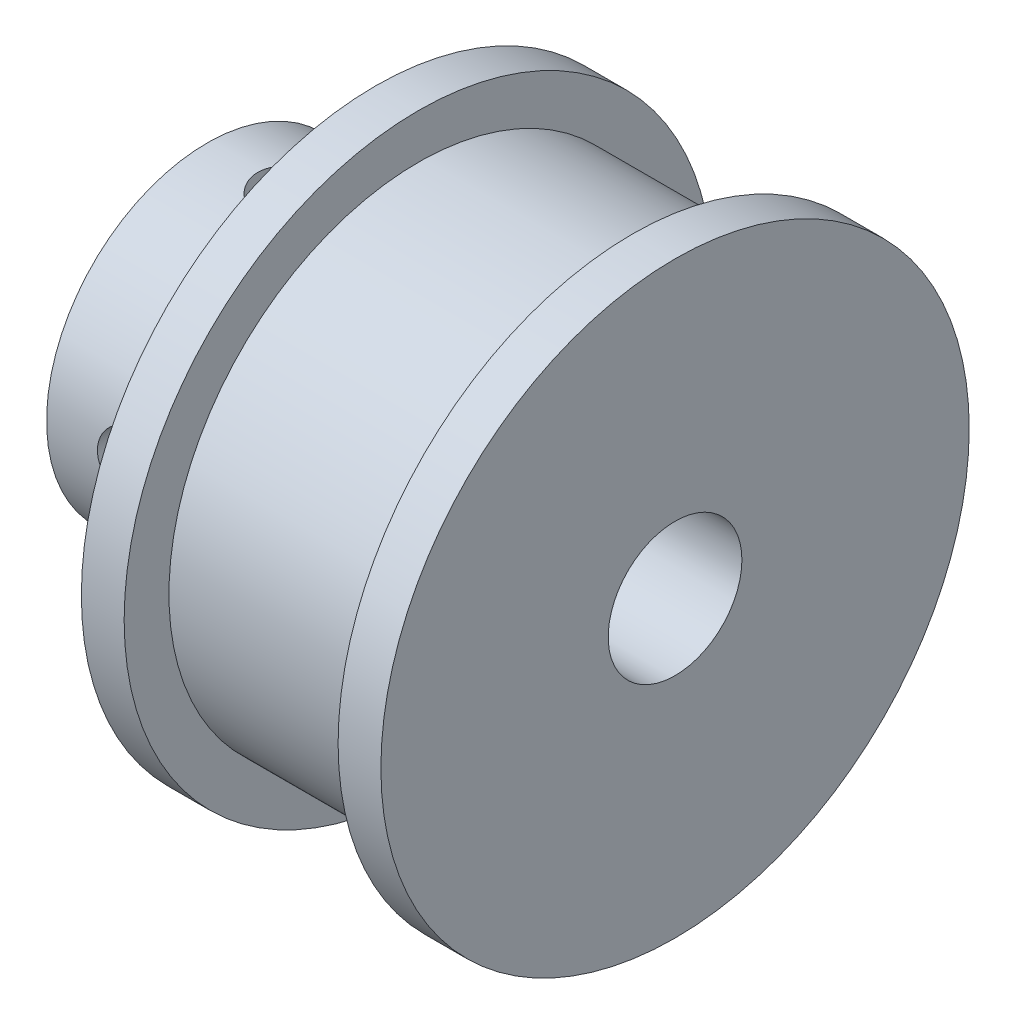
ISO-10303-21;
HEADER;
FILE_DESCRIPTION(('STEP AP214'),'2;1');
FILE_NAME('part.step','',(''),(''),'','','');
FILE_SCHEMA(('AUTOMOTIVE_DESIGN { 1 0 10303 214 1 1 1 1 }'));
ENDSEC;
DATA;
#1=APPLICATION_CONTEXT('core data for automotive mechanical design processes');
#2=APPLICATION_PROTOCOL_DEFINITION('international standard','automotive_design',2000,#1);
#3=PRODUCT_CONTEXT('',#1,'mechanical');
#4=PRODUCT('Part','Part','',(#3));
#5=PRODUCT_RELATED_PRODUCT_CATEGORY('part','',(#4));
#6=PRODUCT_DEFINITION_FORMATION('','',#4);
#7=PRODUCT_DEFINITION_CONTEXT('part definition',#1,'design');
#8=PRODUCT_DEFINITION('design','',#6,#7);
#9=PRODUCT_DEFINITION_SHAPE('','',#8);
#10=(LENGTH_UNIT() NAMED_UNIT(*) SI_UNIT(.MILLI.,.METRE.));
#11=(NAMED_UNIT(*) PLANE_ANGLE_UNIT() SI_UNIT($,.RADIAN.));
#12=(NAMED_UNIT(*) SI_UNIT($,.STERADIAN.) SOLID_ANGLE_UNIT());
#13=UNCERTAINTY_MEASURE_WITH_UNIT(LENGTH_MEASURE(1.E-05),#10,'distance_accuracy_value','');
#14=(GEOMETRIC_REPRESENTATION_CONTEXT(3) GLOBAL_UNCERTAINTY_ASSIGNED_CONTEXT((#13)) GLOBAL_UNIT_ASSIGNED_CONTEXT((#10,
#11,#12)) REPRESENTATION_CONTEXT('',''));
#15=CARTESIAN_POINT('',(0.,0.,0.));
#16=DIRECTION('',(0.,0.,1.));
#17=DIRECTION('',(1.,0.,0.));
#18=AXIS2_PLACEMENT_3D('',#15,#16,#17);
#19=CARTESIAN_POINT('',(0.,0.,0.));
#20=DIRECTION('',(1.,0.,0.));
#21=DIRECTION('',(0.,0.,-1.));
#22=AXIS2_PLACEMENT_3D('',#19,#20,#21);
#23=CYLINDRICAL_SURFACE('',#22,2.5);
#24=CARTESIAN_POINT('',(1.90000000000001,0.,2.5));
#25=CARTESIAN_POINT('',(1.90000412789938,0.0657149536912328,2.49999641755189));
#26=CARTESIAN_POINT('',(1.9052125914021,0.13150824962254,2.49738113774397));
#27=CARTESIAN_POINT('',(1.92581610042616,0.26115029408553,2.48717695046745));
#28=CARTESIAN_POINT('',(1.94123049124707,0.324995108391878,2.4795785978623));
#29=CARTESIAN_POINT('',(1.981492260771,0.448666931100716,2.4602034925414));
#30=CARTESIAN_POINT('',(2.00630298031002,0.508508503673972,2.448442989719));
#31=CARTESIAN_POINT('',(2.06446327670618,0.623090771008203,2.42182220644723));
#32=CARTESIAN_POINT('',(2.09781218031107,0.677831867487559,2.40696217041913));
#33=CARTESIAN_POINT('',(2.17439656185663,0.784384772202395,2.37445322822571));
#34=CARTESIAN_POINT('',(2.21810809904956,0.835819013902635,2.3566899890942));
#35=CARTESIAN_POINT('',(2.3131518490588,0.930974306083717,2.32074962808431));
#36=CARTESIAN_POINT('',(2.36448981471556,0.974689478883453,2.30257220261294));
#37=CARTESIAN_POINT('',(2.47810418690423,1.05656500056284,2.26623688996684));
#38=CARTESIAN_POINT('',(2.5409201229324,1.09403166943954,2.24818983712665));
#39=CARTESIAN_POINT('',(2.67295916998277,1.15771028361336,2.21607473465401));
#40=CARTESIAN_POINT('',(2.74217766090344,1.18393026870791,2.20200384508737));
#41=CARTESIAN_POINT('',(2.88083138177741,1.22266555273573,2.18072333797261));
#42=CARTESIAN_POINT('',(2.95000556508425,1.23590732135054,2.17315339479642));
#43=CARTESIAN_POINT('',(3.08997354722435,1.25053374163605,2.1647736243566));
#44=CARTESIAN_POINT('',(3.16076567608894,1.25193011046634,2.16395711679111));
#45=CARTESIAN_POINT('',(3.29285753039421,1.24335910896536,2.16888662821561));
#46=CARTESIAN_POINT('',(3.35428003902881,1.23473069942102,2.17385954577517));
#47=CARTESIAN_POINT('',(3.4746523867163,1.20867481132116,2.18845285917313));
#48=CARTESIAN_POINT('',(3.53360143163164,1.19124452987206,2.19807473539721));
#49=CARTESIAN_POINT('',(3.64903641570707,1.1477622254825,2.22109345515927));
#50=CARTESIAN_POINT('',(3.70543299848223,1.12151883389499,2.23457300829999));
#51=CARTESIAN_POINT('',(3.81329286573751,1.061302109585,2.26379255351755));
#52=CARTESIAN_POINT('',(3.86475391950011,1.02732530476558,2.27953355975239));
#53=CARTESIAN_POINT('',(3.96815156592903,0.947582568640978,2.31391447379108));
#54=CARTESIAN_POINT('',(4.01932109197019,0.900868072961595,2.33266887795933));
#55=CARTESIAN_POINT('',(4.11341927323862,0.799444473426711,2.36934529125509));
#56=CARTESIAN_POINT('',(4.15634399004235,0.744731570717851,2.38726689948501));
#57=CARTESIAN_POINT('',(4.23460707628715,0.625645632289805,2.42127484103705));
#58=CARTESIAN_POINT('',(4.26950059055717,0.560941989499256,2.43723730202509));
#59=CARTESIAN_POINT('',(4.32762128630376,0.425582769360992,2.46447351401553));
#60=CARTESIAN_POINT('',(4.35085773126895,0.354931970331592,2.47575098679441));
#61=CARTESIAN_POINT('',(4.38309425464584,0.215958114575874,2.49155417176795));
#62=CARTESIAN_POINT('',(4.39311404468347,0.147926913185403,2.4965617287664));
#63=CARTESIAN_POINT('',(4.40183091391811,0.0109744999366904,2.50091266823877));
#64=CARTESIAN_POINT('',(4.40053335704934,-0.0579462748373779,2.5002587340164));
#65=CARTESIAN_POINT('',(4.38724163947655,-0.189041214982493,2.49363990316801));
#66=CARTESIAN_POINT('',(4.37608433408746,-0.251324260062443,2.48809057110237));
#67=CARTESIAN_POINT('',(4.34470241013114,-0.373008615377396,2.47277714143524));
#68=CARTESIAN_POINT('',(4.32447679193329,-0.432409607113745,2.46301257917916));
#69=CARTESIAN_POINT('',(4.27500191695853,-0.54861076056208,2.43980314267087));
#70=CARTESIAN_POINT('',(4.24551118735398,-0.60528799625769,2.42626102212424));
#71=CARTESIAN_POINT('',(4.17861558044244,-0.713076702123649,2.39679967896386));
#72=CARTESIAN_POINT('',(4.1412073317582,-0.7641857872191,2.38087944457232));
#73=CARTESIAN_POINT('',(4.0552994683339,-0.864709611613313,2.34635276671831));
#74=CARTESIAN_POINT('',(4.00607141443304,-0.913465097280795,2.32763606060552));
#75=CARTESIAN_POINT('',(3.90009356091336,-1.00232040139155,2.29077989504843));
#76=CARTESIAN_POINT('',(3.84333860147953,-1.04241423211355,2.27264084226908));
#77=CARTESIAN_POINT('',(3.72044543224961,-1.11463489312211,2.23813990282585));
#78=CARTESIAN_POINT('',(3.65398591723925,-1.14628186984829,2.2219066207934));
#79=CARTESIAN_POINT('',(3.51561241538434,-1.19760353251725,2.19467590460158));
#80=CARTESIAN_POINT('',(3.44370559187351,-1.21729364485946,2.18367172800773));
#81=CARTESIAN_POINT('',(3.30386222142319,-1.24232710931209,2.16951876260834));
#82=CARTESIAN_POINT('',(3.2362071832137,-1.24886624550107,2.16571729325615));
#83=CARTESIAN_POINT('',(3.10069116603659,-1.25086144297598,2.16456693307719));
#84=CARTESIAN_POINT('',(3.03283028907571,-1.24632230828049,2.16721524534441));
#85=CARTESIAN_POINT('',(2.90564562308498,-1.22740765699032,2.17797327562531));
#86=CARTESIAN_POINT('',(2.8461244123195,-1.21401039292849,2.18553868102993));
#87=CARTESIAN_POINT('',(2.73023985071912,-1.1789691977808,2.20463770234897));
#88=CARTESIAN_POINT('',(2.67387752238504,-1.15732261394975,2.21617259462095));
#89=CARTESIAN_POINT('',(2.56171893626674,-1.10476968162585,2.24285662955661));
#90=CARTESIAN_POINT('',(2.50621512271288,-1.07333892227056,2.25819652995239));
#91=CARTESIAN_POINT('',(2.40090682977427,-1.00268871454578,2.29044164543238));
#92=CARTESIAN_POINT('',(2.35110533685189,-0.963465214048302,2.30734767243153));
#93=CARTESIAN_POINT('',(2.25232252205298,-0.872754158330794,2.34327903949142));
#94=CARTESIAN_POINT('',(2.2041761220476,-0.820355528762706,2.36231229139336));
#95=CARTESIAN_POINT('',(2.11717127072046,-0.707693507775342,2.3984719031886));
#96=CARTESIAN_POINT('',(2.07831782571714,-0.647425904070974,2.4155972326005));
#97=CARTESIAN_POINT('',(2.01095454654725,-0.519914496024927,2.44622511981379));
#98=CARTESIAN_POINT('',(1.98251978823571,-0.452624379918261,2.45970120703636));
#99=CARTESIAN_POINT('',(1.93773979010132,-0.313427626617733,2.48126676704332));
#100=CARTESIAN_POINT('',(1.92136019146304,-0.241534749528952,2.48937154216165));
#101=CARTESIAN_POINT('',(1.9076282361552,-0.140752433104225,2.49619327387079));
#102=CARTESIAN_POINT('',(1.90477169892048,-0.112702349299369,2.49761706674002));
#103=CARTESIAN_POINT('',(1.900956668104,-0.0564396647589448,2.49952121222331));
#104=CARTESIAN_POINT('',(1.89999822691101,-0.0282270595592256,2.50000153879704));
#105=CARTESIAN_POINT('',(1.90000000000001,0.,2.5));
#106=B_SPLINE_CURVE_WITH_KNOTS('',3,(#24,#25,#26,#27,#28,#29,#30,#31,#32,#33,#34,#35,#36,#37,
#38,#39,#40,#41,#42,#43,#44,#45,#46,#47,#48,#49,#50,#51,#52,#53,#54,#55,#56,#57,#58,#59,#60,#61,
#62,#63,#64,#65,#66,#67,#68,#69,#70,#71,#72,#73,#74,#75,#76,#77,#78,#79,#80,#81,#82,#83,#84,#85,
#86,#87,#88,#89,#90,#91,#92,#93,#94,#95,#96,#97,#98,#99,#100,#101,#102,#103,#104,#105),
.UNSPECIFIED.,.T.,.F.,(4,2,2,2,2,2,2,2,2,2,2,2,2,2,2,2,2,2,2,2,2,2,2,2,2,2,2,2,2,2,2,2,2,2,2,2,
2,2,2,2,4),(0.,0.197030321775365,0.394435187136495,0.59107769436537,0.787704700726955,
0.996227198397605,1.20490779706754,1.4297715803844,1.6544743487285,1.86572515175286,
2.07676696661274,2.26257140511649,2.44843504907097,2.63862800210608,2.82890651575276,
3.04331176667346,3.25781918248356,3.48228777768049,3.70657771140347,3.9122911308918,
4.11790705639343,4.3075863313265,4.49728652038662,4.6924107003487,4.88761813435421,
5.10199513305521,5.31651985769287,5.54143352699589,5.76605639925969,5.96911634372963,
6.17208824825003,6.35572412805224,6.53941910979594,6.73545570969514,6.93159451423693,
7.15156553440619,7.37165479220712,7.59330017078652,7.81431135781158,7.89894100172117,
7.98357298143554),.UNSPECIFIED.);
#107=CARTESIAN_POINT('',(1.90000000000001,0.,2.5));
#108=VERTEX_POINT('',#107);
#109=EDGE_CURVE('E3252',#108,#108,#106,.T.);
#110=ORIENTED_EDGE('',*,*,#109,.F.);
#111=EDGE_LOOP('',(#110));
#112=FACE_BOUND('',#111,.T.);
#113=CARTESIAN_POINT('',(3.15,2.1650635094611,-1.25));
#114=CARTESIAN_POINT('',(3.21513476024406,2.16506918410574,-1.24999545384316));
#115=CARTESIAN_POINT('',(3.28035176440631,2.16804751484696,-1.24487496341652));
#116=CARTESIAN_POINT('',(3.40878408084644,2.17952958065066,-1.22465401237257));
#117=CARTESIAN_POINT('',(3.47199489380426,2.18804492569449,-1.20953258069272));
#118=CARTESIAN_POINT('',(3.59431458042993,2.20936683256748,-1.17012493587476));
#119=CARTESIAN_POINT('',(3.65344331559198,2.22215054341565,-1.14588744061716));
#120=CARTESIAN_POINT('',(3.7667802524959,2.25053331021072,-1.08908440672046));
#121=CARTESIAN_POINT('',(3.82098818782807,2.26613251845081,-1.05651841754472));
#122=CARTESIAN_POINT('',(3.92788216069688,2.29996086321802,-0.980833175663597));
#123=CARTESIAN_POINT('',(3.98007391959193,2.31830079547442,-0.937065045179712));
#124=CARTESIAN_POINT('',(4.07676048550839,2.35464978482132,-0.841567259518084));
#125=CARTESIAN_POINT('',(4.1212514532294,2.37265867289062,-0.789833657227865));
#126=CARTESIAN_POINT('',(4.20420893893458,2.40776846191186,-0.675611954268182));
#127=CARTESIAN_POINT('',(4.24206720982441,2.42472633022716,-0.612633986265718));
#128=CARTESIAN_POINT('',(4.3064260665572,2.45438445124411,-0.480196283249379));
#129=CARTESIAN_POINT('',(4.33293382017146,2.46708738979677,-0.410740672672693));
#130=CARTESIAN_POINT('',(4.37188082662637,2.48600576555297,-0.272556179907471));
#131=CARTESIAN_POINT('',(4.38518690794442,2.49261850276115,-0.204127238111022));
#132=CARTESIAN_POINT('',(4.4002076483438,2.50009479807584,-0.0657132858723104));
#133=CARTESIAN_POINT('',(4.40192932099464,2.50096183480737,0.00427075730467285));
#134=CARTESIAN_POINT('',(4.39406665753706,2.49703727395563,0.137290655529687));
#135=CARTESIAN_POINT('',(4.38545248059847,2.49273119865201,0.200401498970989));
#136=CARTESIAN_POINT('',(4.35889894511918,2.47967806574684,0.324142214897902));
#137=CARTESIAN_POINT('',(4.34095888877972,2.47093067582992,0.384771901367406));
#138=CARTESIAN_POINT('',(4.29614679238773,2.44964479109568,0.502886739461941));
#139=CARTESIAN_POINT('',(4.26915460853492,2.43705551911499,0.560316779393972));
#140=CARTESIAN_POINT('',(4.20717072974813,2.40922057483359,0.66997100189166));
#141=CARTESIAN_POINT('',(4.17217617087206,2.39397395196855,0.722193311048306));
#142=CARTESIAN_POINT('',(4.09138081058373,2.36055492999037,0.825217076122743));
#143=CARTESIAN_POINT('',(4.04487121459249,2.34224219997719,0.8754175937867));
#144=CARTESIAN_POINT('',(3.94426284383728,2.30567925733515,0.967630462872224));
#145=CARTESIAN_POINT('',(3.89015828465742,2.28742910332036,1.00963651446779));
#146=CARTESIAN_POINT('',(3.77168975946989,2.25180195115606,1.08688166830276));
#147=CARTESIAN_POINT('',(3.70689247118224,2.23455399988385,1.12152164372256));
#148=CARTESIAN_POINT('',(3.57132791080125,2.2046931284822,1.17914889125154));
#149=CARTESIAN_POINT('',(3.50056695872805,2.19207537557584,1.20214832276361));
#150=CARTESIAN_POINT('',(3.36098186089651,2.17430794771293,1.2339752637813));
#151=CARTESIAN_POINT('',(3.29244860119556,2.16864569810621,1.24378140264997));
#152=CARTESIAN_POINT('',(3.15449832310432,2.16397399202012,1.25189618326428));
#153=CARTESIAN_POINT('',(3.08508196360027,2.1649598361164,1.25021294664378));
#154=CARTESIAN_POINT('',(2.95543260177659,2.17292920675731,1.23629505417996));
#155=CARTESIAN_POINT('',(2.89502568611509,2.17924484383318,1.22523477089058));
#156=CARTESIAN_POINT('',(2.7770402671613,2.19617526939177,1.19462035579055));
#157=CARTESIAN_POINT('',(2.71946268656674,2.20679145006292,1.17506347327952));
#158=CARTESIAN_POINT('',(2.60573583637163,2.23170277599571,1.12705948575611));
#159=CARTESIAN_POINT('',(2.54977622893306,2.24614554053829,1.0982425796159));
#160=CARTESIAN_POINT('',(2.44316341057626,2.27695149371562,1.03285883001975));
#161=CARTESIAN_POINT('',(2.3925129456084,2.29331566693935,0.996288005415269));
#162=CARTESIAN_POINT('',(2.29127654059557,2.3285999807042,0.911046458998566));
#163=CARTESIAN_POINT('',(2.24150356160293,2.34758228942861,0.861431590393707));
#164=CARTESIAN_POINT('',(2.15073470250801,2.38417793722366,0.754255619247859));
#165=CARTESIAN_POINT('',(2.10974178721183,2.40179081259637,0.696691843319182));
#166=CARTESIAN_POINT('',(2.03678284256238,2.43426702113696,0.573169203198445));
#167=CARTESIAN_POINT('',(2.00508360223636,2.44904552090037,0.50702887196764));
#168=CARTESIAN_POINT('',(1.95357762017826,2.47354193699126,0.369402955801352));
#169=CARTESIAN_POINT('',(1.93376043579212,2.48326429595466,0.297922126740219));
#170=CARTESIAN_POINT('',(1.90828929478168,2.49584385227353,0.158724602913021));
#171=CARTESIAN_POINT('',(1.90150265515486,2.49924909885239,0.0912643048130704));
#172=CARTESIAN_POINT('',(1.898945918182,2.50052662968914,-0.0439074824390051));
#173=CARTESIAN_POINT('',(1.90317196434555,2.49840085083612,-0.111618875368859));
#174=CARTESIAN_POINT('',(1.92177050849453,2.48917461047403,-0.240672490396434));
#175=CARTESIAN_POINT('',(1.93545606157209,2.48241118334987,-0.30214039726408));
#176=CARTESIAN_POINT('',(1.97165874912872,2.46490117079279,-0.421807440229522));
#177=CARTESIAN_POINT('',(1.99417715011682,2.45415401415995,-0.480006106194386));
#178=CARTESIAN_POINT('',(2.04840881520747,2.4290741343515,-0.594279257806106));
#179=CARTESIAN_POINT('',(2.0804741540098,2.41460771498499,-0.650156428375058));
#180=CARTESIAN_POINT('',(2.15244741357382,2.38360166427283,-0.755968302267531));
#181=CARTESIAN_POINT('',(2.19235893639459,2.36706108197951,-0.805900259268634));
#182=CARTESIAN_POINT('',(2.28349642377838,2.33160762783285,-0.903642505196113));
#183=CARTESIAN_POINT('',(2.33545310934649,2.31262248764622,-0.950747105674089));
#184=CARTESIAN_POINT('',(2.44681340141222,2.27578845203566,-1.03582910924334));
#185=CARTESIAN_POINT('',(2.50622352608461,2.25794057202332,-1.07379843751257));
#186=CARTESIAN_POINT('',(2.6332958082262,2.22499506631145,-1.14053884973207));
#187=CARTESIAN_POINT('',(2.70115941391092,2.21000217820338,-1.16898133245117));
#188=CARTESIAN_POINT('',(2.84166550542472,2.1858269541044,-1.21359838688301));
#189=CARTESIAN_POINT('',(2.91429111114086,2.17662520184628,-1.22981398896918));
#190=CARTESIAN_POINT('',(3.014756694565,2.16911590752238,-1.24295875983052));
#191=CARTESIAN_POINT('',(3.04170986799736,2.1676016125644,-1.24559513120481));
#192=CARTESIAN_POINT('',(3.09577060085281,2.16557419859688,-1.24911675636245));
#193=CARTESIAN_POINT('',(3.12287817048234,2.16506114656387,-1.25000189299984));
#194=CARTESIAN_POINT('',(3.15,2.1650635094611,-1.25));
#195=B_SPLINE_CURVE_WITH_KNOTS('',3,(#113,#114,#115,#116,#117,#118,#119,#120,#121,#122,#123,
#124,#125,#126,#127,#128,#129,#130,#131,#132,#133,#134,#135,#136,#137,#138,#139,#140,#141,#142,
#143,#144,#145,#146,#147,#148,#149,#150,#151,#152,#153,#154,#155,#156,#157,#158,#159,#160,#161,
#162,#163,#164,#165,#166,#167,#168,#169,#170,#171,#172,#173,#174,#175,#176,#177,#178,#179,#180,
#181,#182,#183,#184,#185,#186,#187,#188,#189,#190,#191,#192,#193,#194),.UNSPECIFIED.,.T.,.F.,(4,
2,2,2,2,2,2,2,2,2,2,2,2,2,2,2,2,2,2,2,2,2,2,2,2,2,2,2,2,2,2,2,2,2,2,2,2,2,2,2,4),(0.,
0.195290153243394,0.390991116031006,0.585660744898607,0.780340906806436,0.991077890622791,
1.20191963855464,1.42697365298454,1.65188533704864,1.86079356209919,2.0695752960755,
2.26020121855673,2.45084140646819,2.64411918413933,2.83746624187839,3.04908989321113,
3.26087560307398,3.4861105216181,3.71110967764631,3.91827863567764,4.12530116485466,
4.30967729280031,4.49411315545078,4.68709120507609,4.88016857775059,5.09758429475766,
5.31507331222752,5.53830226766207,5.76133474760964,5.96390337986858,6.16640108492464,
6.35555531089365,6.54473666890015,6.74200938399339,6.93937287625898,7.15637802312583,
7.37357428556442,7.59763436298255,7.82093916253449,7.90225168981636,7.98356965618175),.UNSPECIFIED.);
#196=CARTESIAN_POINT('',(3.15,2.1650635094611,-1.25));
#197=VERTEX_POINT('',#196);
#198=EDGE_CURVE('E3251',#197,#197,#195,.T.);
#199=ORIENTED_EDGE('',*,*,#198,.F.);
#200=EDGE_LOOP('',(#199));
#201=FACE_BOUND('',#200,.T.);
#202=CARTESIAN_POINT('',(17.5,0.,0.));
#203=DIRECTION('',(1.,0.,0.));
#204=DIRECTION('',(0.,0.,-1.));
#205=AXIS2_PLACEMENT_3D('',#202,#203,#204);
#206=CIRCLE('',#205,2.5);
#207=CARTESIAN_POINT('',(17.5,0.,-2.5));
#208=VERTEX_POINT('',#207);
#209=EDGE_CURVE('E3272',#208,#208,#206,.T.);
#210=ORIENTED_EDGE('',*,*,#209,.T.);
#211=EDGE_LOOP('',(#210));
#212=FACE_BOUND('',#211,.T.);
#213=CARTESIAN_POINT('',(0.,0.,0.));
#214=DIRECTION('',(1.,0.,0.));
#215=DIRECTION('',(0.,0.,-1.));
#216=AXIS2_PLACEMENT_3D('',#213,#214,#215);
#217=CIRCLE('',#216,2.5);
#218=CARTESIAN_POINT('',(0.,0.,-2.5));
#219=VERTEX_POINT('',#218);
#220=EDGE_CURVE('E12',#219,#219,#217,.T.);
#221=ORIENTED_EDGE('',*,*,#220,.F.);
#222=EDGE_LOOP('',(#221));
#223=FACE_BOUND('',#222,.T.);
#224=ADVANCED_FACE('F3226',(#112,#201,#212,#223),#23,.F.);
#225=CARTESIAN_POINT('',(0.,2.5,0.));
#226=DIRECTION('',(-1.,0.,0.));
#227=DIRECTION('',(0.,0.,1.));
#228=AXIS2_PLACEMENT_3D('',#225,#226,#227);
#229=PLANE('',#228);
#230=ORIENTED_EDGE('',*,*,#220,.T.);
#231=EDGE_LOOP('',(#230));
#232=FACE_BOUND('',#231,.T.);
#233=CARTESIAN_POINT('',(0.,0.,0.));
#234=DIRECTION('',(1.,0.,0.));
#235=DIRECTION('',(0.,0.,-1.));
#236=AXIS2_PLACEMENT_3D('',#233,#234,#235);
#237=CIRCLE('',#236,6.);
#238=CARTESIAN_POINT('',(0.,0.,-6.));
#239=VERTEX_POINT('',#238);
#240=EDGE_CURVE('E3238',#239,#239,#237,.T.);
#241=ORIENTED_EDGE('',*,*,#240,.F.);
#242=EDGE_LOOP('',(#241));
#243=FACE_BOUND('',#242,.T.);
#244=ADVANCED_FACE('F3301',(#232,#243),#229,.T.);
#245=CARTESIAN_POINT('',(0.,0.,0.));
#246=DIRECTION('',(1.,0.,0.));
#247=DIRECTION('',(0.,0.,-1.));
#248=AXIS2_PLACEMENT_3D('',#245,#246,#247);
#249=CYLINDRICAL_SURFACE('',#248,6.);
#250=CARTESIAN_POINT('',(1.90000000000001,0.,6.));
#251=CARTESIAN_POINT('',(1.90000247746923,-0.0694090417016603,5.99999871526651));
#252=CARTESIAN_POINT('',(1.90580066571876,-0.138848789520875,5.99878328775043));
#253=CARTESIAN_POINT('',(1.92881934953286,-0.275761316266992,5.99405200990679));
#254=CARTESIAN_POINT('',(1.94604852303694,-0.343232560128311,5.99053441189248));
#255=CARTESIAN_POINT('',(1.99137045492183,-0.474209132291339,5.98159109196202));
#256=CARTESIAN_POINT('',(2.01945239599889,-0.537718336709182,5.97616727052645));
#257=CARTESIAN_POINT('',(2.08564960885619,-0.659120328605954,5.96399927809859));
#258=CARTESIAN_POINT('',(2.12376443115584,-0.717013367534323,5.95725516625975));
#259=CARTESIAN_POINT('',(2.20953634019065,-0.826390324308832,5.9430770002465));
#260=CARTESIAN_POINT('',(2.25731200123509,-0.87778024416268,5.93563505848531));
#261=CARTESIAN_POINT('',(2.36079465919511,-0.971877776769387,5.92095657692448));
#262=CARTESIAN_POINT('',(2.41650231187227,-1.01458467096098,5.91372005416683));
#263=CARTESIAN_POINT('',(2.53495196876616,-1.09051031677216,5.90019442595308));
#264=CARTESIAN_POINT('',(2.59775838450275,-1.1236305468065,5.89391545174828));
#265=CARTESIAN_POINT('',(2.72819745177276,-1.17881119348063,5.8831284065002));
#266=CARTESIAN_POINT('',(2.79582958244254,-1.20087280167641,5.87862014467568));
#267=CARTESIAN_POINT('',(2.93298523741564,-1.23300240133736,5.87196500986123));
#268=CARTESIAN_POINT('',(3.00246835933477,-1.24323597696798,5.86978556855865));
#269=CARTESIAN_POINT('',(3.14219684286263,-1.25193357655614,5.86793690716491));
#270=CARTESIAN_POINT('',(3.2124421188653,-1.25039890894686,5.86826740800981));
#271=CARTESIAN_POINT('',(3.35048102797518,-1.23573719037196,5.87137174319175));
#272=CARTESIAN_POINT('',(3.41829597966121,-1.2228010523272,5.87410533679901));
#273=CARTESIAN_POINT('',(3.55077150964493,-1.18600543529945,5.88164437615942));
#274=CARTESIAN_POINT('',(3.61543192560633,-1.16214539481381,5.88644992841317));
#275=CARTESIAN_POINT('',(3.74030722841598,-1.10400003213928,5.89763191464102));
#276=CARTESIAN_POINT('',(3.80048629652707,-1.06964002534236,5.90401953785586));
#277=CARTESIAN_POINT('',(3.91429574426816,-0.991522699274812,5.91763890010721));
#278=CARTESIAN_POINT('',(3.96792530883597,-0.947764212262582,5.92487074398537));
#279=CARTESIAN_POINT('',(4.06821396108037,-0.851074921546777,5.93953730929909));
#280=CARTESIAN_POINT('',(4.11471616889701,-0.797981433412077,5.94697323199473));
#281=CARTESIAN_POINT('',(4.19818044222897,-0.684667288611794,5.96108088143001));
#282=CARTESIAN_POINT('',(4.23514236459839,-0.624446525025762,5.96775259670236));
#283=CARTESIAN_POINT('',(4.29851008153595,-0.498405541235475,5.97959870942815));
#284=CARTESIAN_POINT('',(4.32489680456711,-0.432575461926497,5.98477039710258));
#285=CARTESIAN_POINT('',(4.36619170483549,-0.297284620972153,5.99301338211281));
#286=CARTESIAN_POINT('',(4.38110139323139,-0.227824338595088,5.99608495596053));
#287=CARTESIAN_POINT('',(4.39879425206788,-0.0885918657008349,5.99974275215455));
#288=CARTESIAN_POINT('',(4.40179194149424,-0.0188480555261788,6.00037293537579));
#289=CARTESIAN_POINT('',(4.39615505003089,0.120143798757714,5.99919952252774));
#290=CARTESIAN_POINT('',(4.3875211813984,0.189391872962257,5.99739607548153));
#291=CARTESIAN_POINT('',(4.35904434653046,0.324726367119811,5.99158564979184));
#292=CARTESIAN_POINT('',(4.33931251461653,0.390837192894204,5.98760052868077));
#293=CARTESIAN_POINT('',(4.28932213957859,0.518811446661328,5.97787227242395));
#294=CARTESIAN_POINT('',(4.25906275913401,0.580674536336772,5.97212899744579));
#295=CARTESIAN_POINT('',(4.18841962176244,0.69929430694349,5.95941241490714));
#296=CARTESIAN_POINT('',(4.14790807043093,0.755973219469829,5.9524239381233));
#297=CARTESIAN_POINT('',(4.05808043692373,0.861805445886515,5.93802568299709));
#298=CARTESIAN_POINT('',(4.00876332448106,0.910957877913281,5.93061585542511));
#299=CARTESIAN_POINT('',(3.9017444230003,1.0011786486518,5.91606024531377));
#300=CARTESIAN_POINT('',(3.84391696804472,1.04209914600204,5.90892089307501));
#301=CARTESIAN_POINT('',(3.72208371578621,1.11364719079243,5.89585601015805));
#302=CARTESIAN_POINT('',(3.65807817586089,1.14427516677863,5.88993042894651));
#303=CARTESIAN_POINT('',(3.52603880370177,1.19417246443921,5.88001700708041));
#304=CARTESIAN_POINT('',(3.45802896283416,1.21350309828031,5.87601872784687));
#305=CARTESIAN_POINT('',(3.31963344950774,1.24044038523407,5.87039184709697));
#306=CARTESIAN_POINT('',(3.24924811838056,1.2480487154444,5.86876290660367));
#307=CARTESIAN_POINT('',(3.10958659900035,1.25125926487611,5.86807907308506));
#308=CARTESIAN_POINT('',(3.04031592977795,1.24709542622725,5.86897402321502));
#309=CARTESIAN_POINT('',(2.90348599107978,1.22739905314031,5.87312447254928));
#310=CARTESIAN_POINT('',(2.8359267051839,1.21186662782265,5.87637994909626));
#311=CARTESIAN_POINT('',(2.70460222810934,1.16998217768584,5.88486132447716));
#312=CARTESIAN_POINT('',(2.64082675351308,1.14366117568421,5.8900815700793));
#313=CARTESIAN_POINT('',(2.51856122397334,1.08097457299757,5.90190705738738));
#314=CARTESIAN_POINT('',(2.46007166036688,1.04460803983029,5.9085124276546));
#315=CARTESIAN_POINT('',(2.34887837292056,0.962073695342405,5.92251579551146));
#316=CARTESIAN_POINT('',(2.29630087543502,0.91573789041822,5.92992613868404));
#317=CARTESIAN_POINT('',(2.19959050677365,0.814924438115329,5.94461839583213));
#318=CARTESIAN_POINT('',(2.15545958244852,0.760444918832963,5.9519002798488));
#319=CARTESIAN_POINT('',(2.07641142681595,0.644134427507699,5.96561444547637));
#320=CARTESIAN_POINT('',(2.04160632011372,0.582225921521345,5.97203596073244));
#321=CARTESIAN_POINT('',(1.98294977156998,0.453319843998451,5.98319908494092));
#322=CARTESIAN_POINT('',(1.95908875281813,0.386326781907242,5.98794216182101));
#323=CARTESIAN_POINT('',(1.92745972171158,0.266015292900104,5.99432499781443));
#324=CARTESIAN_POINT('',(1.91718123679115,0.213367593727928,5.99644035661395));
#325=CARTESIAN_POINT('',(1.90345054572268,0.107152674176536,5.99927832789758));
#326=CARTESIAN_POINT('',(1.89999808733282,0.0535854878488715,6.00000099184586));
#327=CARTESIAN_POINT('',(1.90000000000001,0.,6.));
#328=B_SPLINE_CURVE_WITH_KNOTS('',3,(#250,#251,#252,#253,#254,#255,#256,#257,#258,#259,#260,
#261,#262,#263,#264,#265,#266,#267,#268,#269,#270,#271,#272,#273,#274,#275,#276,#277,#278,#279,
#280,#281,#282,#283,#284,#285,#286,#287,#288,#289,#290,#291,#292,#293,#294,#295,#296,#297,#298,
#299,#300,#301,#302,#303,#304,#305,#306,#307,#308,#309,#310,#311,#312,#313,#314,#315,#316,#317,
#318,#319,#320,#321,#322,#323,#324,#325,#326,#327),.UNSPECIFIED.,.T.,.F.,(4,2,2,2,2,2,2,2,2,2,2,
2,2,2,2,2,2,2,2,2,2,2,2,2,2,2,2,2,2,2,2,2,2,2,2,2,2,2,4),(0.,0.208031045103182,
0.416220199906223,0.624202378825439,0.832175241572985,1.04287526388122,1.25359271551785,
1.46640449178548,1.67919333285489,1.88896575169853,2.09871484767163,2.30501712129058,
2.51133000030278,2.71914592416748,2.92698768368033,3.13889526355464,3.35080602278216,
3.5630972449966,3.77536051045769,3.98378339407673,4.19219351552275,4.39855286632619,
4.60492863390931,4.81401583995734,5.02312752564571,5.23571263829333,5.44828889851306,
5.65970050095022,5.87108185414182,6.07829223291035,6.28550062281358,6.49211731393252,
6.69875319081476,6.90919024830305,7.11967575117366,7.33258864398252,7.54531486464969,
7.70592588477276,7.86653096973387),.UNSPECIFIED.);
#329=CARTESIAN_POINT('',(1.90000000000001,0.,6.));
#330=VERTEX_POINT('',#329);
#331=EDGE_CURVE('E3230',#330,#330,#328,.T.);
#332=ORIENTED_EDGE('',*,*,#331,.F.);
#333=EDGE_LOOP('',(#332));
#334=FACE_BOUND('',#333,.T.);
#335=CARTESIAN_POINT('',(3.15,5.86834729715275,-1.25));
#336=CARTESIAN_POINT('',(3.08060938484897,5.86834869213645,-1.24999750877599));
#337=CARTESIAN_POINT('',(3.01118802798478,5.86959145924544,-1.24420229433948));
#338=CARTESIAN_POINT('',(2.87431368268275,5.87442015581798,-1.22119649233779));
#339=CARTESIAN_POINT('',(2.80686224449358,5.87800788138388,-1.20397715440342));
#340=CARTESIAN_POINT('',(2.67592762716513,5.8871029296193,-1.1586839750723));
#341=CARTESIAN_POINT('',(2.6124404040082,5.89260825706945,-1.13062141248932));
#342=CARTESIAN_POINT('',(2.4910755003544,5.90491581335741,-1.06446988601732));
#343=CARTESIAN_POINT('',(2.43319759326998,5.91171798977622,-1.0263813273582));
#344=CARTESIAN_POINT('',(2.32380462484654,5.92596934661468,-0.940636399466082));
#345=CARTESIAN_POINT('',(2.27238810637353,5.93342614373039,-0.892855554869668));
#346=CARTESIAN_POINT('',(2.1782389313519,5.94807966802575,-0.789351223880636));
#347=CARTESIAN_POINT('',(2.13550691170856,5.95527637609915,-0.733627155456002));
#348=CARTESIAN_POINT('',(2.05955411191714,5.96868135118848,-0.615162052999588));
#349=CARTESIAN_POINT('',(2.02642747353674,5.97487958631242,-0.552359428204941));
#350=CARTESIAN_POINT('',(1.97123394714022,5.98550347343302,-0.421928551006719));
#351=CARTESIAN_POINT('',(1.94916593484647,5.98992930561222,-0.354300789950591));
#352=CARTESIAN_POINT('',(1.91702423888253,5.99645589892179,-0.217162904200502));
#353=CARTESIAN_POINT('',(1.90678398280484,5.99858891959926,-0.147693380916357));
#354=CARTESIAN_POINT('',(1.89806830424298,6.00040112580612,-0.00799184883952432));
#355=CARTESIAN_POINT('',(1.8995916558069,6.0000805670369,0.0622400797368385));
#356=CARTESIAN_POINT('',(1.91423460095674,5.99704658090511,0.200326586199572));
#357=CARTESIAN_POINT('',(1.92717471895812,5.99437018956584,0.268201128726475));
#358=CARTESIAN_POINT('',(1.96399862533131,5.98696720898885,0.400793746289752));
#359=CARTESIAN_POINT('',(1.98788287720308,5.98224053291904,0.465511687511022));
#360=CARTESIAN_POINT('',(2.0460800521255,5.97120767323924,0.590460005384683));
#361=CARTESIAN_POINT('',(2.08046229420966,5.96489104125346,0.65065713498165));
#362=CARTESIAN_POINT('',(2.15862800284042,5.95137300440189,0.764493456510647));
#363=CARTESIAN_POINT('',(2.20241263820613,5.94417148958325,0.818131831816418));
#364=CARTESIAN_POINT('',(2.29912162489106,5.92951700233276,0.918394203276912));
#365=CARTESIAN_POINT('',(2.35220305998195,5.92206184975925,0.964866487494794));
#366=CARTESIAN_POINT('',(2.4654820489948,5.90786872648996,1.04827597240488));
#367=CARTESIAN_POINT('',(2.52567976138724,5.9011307717716,1.0852129606998));
#368=CARTESIAN_POINT('',(2.6517122548288,5.88912998409156,1.14856217138454));
#369=CARTESIAN_POINT('',(2.71756065069343,5.88387085232125,1.17494805489727));
#370=CARTESIAN_POINT('',(2.85289161936939,5.8754760641036,1.21623577538673));
#371=CARTESIAN_POINT('',(2.92237367280809,5.87234010507182,1.23113924882349));
#372=CARTESIAN_POINT('',(3.06161970631891,5.86860783239132,1.24880863867017));
#373=CARTESIAN_POINT('',(3.13135458453703,5.86796551863474,1.25179442917998));
#374=CARTESIAN_POINT('',(3.27032581154014,5.86916952018704,1.24613693439294));
#375=CARTESIAN_POINT('',(3.33956219090234,5.87101568152623,1.23749436857863));
#376=CARTESIAN_POINT('',(3.47482051605812,5.87694538226166,1.20901558325484));
#377=CARTESIAN_POINT('',(3.54086866717883,5.88100511282998,1.18929841376871));
#378=CARTESIAN_POINT('',(3.6687239894416,5.8908833850312,1.13935810860919));
#379=CARTESIAN_POINT('',(3.7305307856504,5.89670208191057,1.10913404556146));
#380=CARTESIAN_POINT('',(3.84910644121623,5.90954501937191,1.03854598181485));
#381=CARTESIAN_POINT('',(3.90579220446617,5.91658506648323,0.998045327353962));
#382=CARTESIAN_POINT('',(4.01164324915506,5.93103483993908,0.908234440569878));
#383=CARTESIAN_POINT('',(4.06080768623923,5.93844460766532,0.858923220505172));
#384=CARTESIAN_POINT('',(4.15106271309716,5.95294924316736,0.751900450843339));
#385=CARTESIAN_POINT('',(4.19200409502638,5.9600367471991,0.694061907614551));
#386=CARTESIAN_POINT('',(4.26358875208798,5.97296708772407,0.57220010221636));
#387=CARTESIAN_POINT('',(4.29423248223745,5.97880997920818,0.508177113476881));
#388=CARTESIAN_POINT('',(4.34413867931735,5.98856148270679,0.376142117847919));
#389=CARTESIAN_POINT('',(4.36346916554434,5.99248163136497,0.308156710970195));
#390=CARTESIAN_POINT('',(4.3904144040081,5.99799561410226,0.169813400503473));
#391=CARTESIAN_POINT('',(4.39803069353274,5.99958975342889,0.0994558094616958));
#392=CARTESIAN_POINT('',(4.40126762204851,6.00026408056941,-0.0402133434703387));
#393=CARTESIAN_POINT('',(4.39711189999473,5.99939113754811,-0.109519592177922));
#394=CARTESIAN_POINT('',(4.37741936134707,5.99532874094472,-0.246422870373552));
#395=CARTESIAN_POINT('',(4.36188271359323,5.99213932172839,-0.314019925202702));
#396=CARTESIAN_POINT('',(4.31997220535144,5.98380460077544,-0.445431965492052));
#397=CARTESIAN_POINT('',(4.29362733614689,5.97866453407556,-0.509256550004524));
#398=CARTESIAN_POINT('',(4.230877602268,5.96697995347704,-0.631610567220741));
#399=CARTESIAN_POINT('',(4.19447186165686,5.96043531730246,-0.690139538279511));
#400=CARTESIAN_POINT('',(4.11189033200669,5.94651596786386,-0.80134032129826));
#401=CARTESIAN_POINT('',(4.0655557119433,5.93912880302851,-0.853892633615926));
#402=CARTESIAN_POINT('',(3.96475549900292,5.9244278681135,-0.950552741980385));
#403=CARTESIAN_POINT('',(3.91028797005157,5.91711411595368,-0.994658521571232));
#404=CARTESIAN_POINT('',(3.79399089756656,5.90329191643327,-1.07367451852767));
#405=CARTESIAN_POINT('',(3.73208158853791,5.89679406702551,-1.10846928126994));
#406=CARTESIAN_POINT('',(3.60317484391674,5.88547039658063,-1.16710627925306));
#407=CARTESIAN_POINT('',(3.53618195154699,5.88064310352601,-1.1909581629246));
#408=CARTESIAN_POINT('',(3.41589371843157,5.87414004405196,-1.22256554131861));
#409=CARTESIAN_POINT('',(3.36327046340695,5.87198163591589,-1.2328344900567));
#410=CARTESIAN_POINT('',(3.25710421947899,5.86908475266778,-1.24655254358404));
#411=CARTESIAN_POINT('',(3.20356126768996,5.86834622039193,-1.25000192292741));
#412=CARTESIAN_POINT('',(3.15,5.86834729715275,-1.25));
#413=B_SPLINE_CURVE_WITH_KNOTS('',3,(#335,#336,#337,#338,#339,#340,#341,#342,#343,#344,#345,
#346,#347,#348,#349,#350,#351,#352,#353,#354,#355,#356,#357,#358,#359,#360,#361,#362,#363,#364,
#365,#366,#367,#368,#369,#370,#371,#372,#373,#374,#375,#376,#377,#378,#379,#380,#381,#382,#383,
#384,#385,#386,#387,#388,#389,#390,#391,#392,#393,#394,#395,#396,#397,#398,#399,#400,#401,#402,
#403,#404,#405,#406,#407,#408,#409,#410,#411,#412),.UNSPECIFIED.,.T.,.F.,(4,2,2,2,2,2,2,2,2,2,2,
2,2,2,2,2,2,2,2,2,2,2,2,2,2,2,2,2,2,2,2,2,2,2,2,2,2,2,4),(0.,0.207975654071269,0.41611079241747,
0.624030014802729,0.831940834815791,1.04271333467885,1.25350128663874,1.46629026266844,
1.67905760106933,1.88879048859264,2.09850151896339,2.30497341416461,2.5114540545587,
2.71932871977949,2.9272292410426,3.13905862244913,3.35089272191628,3.56325237332487,
3.77558175387597,3.98397516009792,4.19235567296524,4.39853786231922,4.60473825464031,
4.81383917934651,5.02296356082185,5.23559458753343,5.4482162175904,5.65954599648534,
5.87084803959581,6.07816293922644,6.28547476332981,6.492234105851,6.69901145528173,
6.90938318978573,7.11980508427535,7.33272651358123,7.54545984571988,7.70599867585769,
7.8665310426116),.UNSPECIFIED.);
#414=CARTESIAN_POINT('',(3.15,5.86834729715275,-1.25));
#415=VERTEX_POINT('',#414);
#416=EDGE_CURVE('E3246',#415,#415,#413,.T.);
#417=ORIENTED_EDGE('',*,*,#416,.F.);
#418=EDGE_LOOP('',(#417));
#419=FACE_BOUND('',#418,.T.);
#420=ORIENTED_EDGE('',*,*,#240,.T.);
#421=EDGE_LOOP('',(#420));
#422=FACE_BOUND('',#421,.T.);
#423=CARTESIAN_POINT('',(6.3,0.,0.));
#424=DIRECTION('',(1.,0.,0.));
#425=DIRECTION('',(0.,0.,-1.));
#426=AXIS2_PLACEMENT_3D('',#423,#424,#425);
#427=CIRCLE('',#426,6.);
#428=CARTESIAN_POINT('',(6.3,0.,-6.));
#429=VERTEX_POINT('',#428);
#430=EDGE_CURVE('E3243',#429,#429,#427,.T.);
#431=ORIENTED_EDGE('',*,*,#430,.F.);
#432=EDGE_LOOP('',(#431));
#433=FACE_BOUND('',#432,.T.);
#434=ADVANCED_FACE('F3253',(#334,#419,#422,#433),#249,.T.);
#435=CARTESIAN_POINT('',(6.3,11.,0.));
#436=DIRECTION('',(-1.,0.,0.));
#437=DIRECTION('',(0.,0.,1.));
#438=AXIS2_PLACEMENT_3D('',#435,#436,#437);
#439=PLANE('',#438);
#440=ORIENTED_EDGE('',*,*,#430,.T.);
#441=EDGE_LOOP('',(#440));
#442=FACE_BOUND('',#441,.T.);
#443=CARTESIAN_POINT('',(6.3,0.,0.));
#444=DIRECTION('',(1.,0.,0.));
#445=DIRECTION('',(0.,0.,-1.));
#446=AXIS2_PLACEMENT_3D('',#443,#444,#445);
#447=CIRCLE('',#446,11.);
#448=CARTESIAN_POINT('',(6.3,0.,-11.));
#449=VERTEX_POINT('',#448);
#450=EDGE_CURVE('E3292',#449,#449,#447,.T.);
#451=ORIENTED_EDGE('',*,*,#450,.F.);
#452=EDGE_LOOP('',(#451));
#453=FACE_BOUND('',#452,.T.);
#454=ADVANCED_FACE('F3297',(#442,#453),#439,.T.);
#455=CARTESIAN_POINT('',(0.,0.,0.));
#456=DIRECTION('',(1.,0.,0.));
#457=DIRECTION('',(0.,0.,-1.));
#458=AXIS2_PLACEMENT_3D('',#455,#456,#457);
#459=CYLINDRICAL_SURFACE('',#458,11.);
#460=ORIENTED_EDGE('',*,*,#450,.T.);
#461=EDGE_LOOP('',(#460));
#462=FACE_BOUND('',#461,.T.);
#463=CARTESIAN_POINT('',(7.9,0.,0.));
#464=DIRECTION('',(1.,0.,0.));
#465=DIRECTION('',(0.,0.,-1.));
#466=AXIS2_PLACEMENT_3D('',#463,#464,#465);
#467=CIRCLE('',#466,11.);
#468=CARTESIAN_POINT('',(7.9,0.,-11.));
#469=VERTEX_POINT('',#468);
#470=EDGE_CURVE('E3289',#469,#469,#467,.T.);
#471=ORIENTED_EDGE('',*,*,#470,.F.);
#472=EDGE_LOOP('',(#471));
#473=FACE_BOUND('',#472,.T.);
#474=ADVANCED_FACE('F3307',(#462,#473),#459,.T.);
#475=CARTESIAN_POINT('',(7.9,11.,0.));
#476=DIRECTION('',(1.,0.,0.));
#477=DIRECTION('',(0.,0.,-1.));
#478=AXIS2_PLACEMENT_3D('',#475,#476,#477);
#479=PLANE('',#478);
#480=ORIENTED_EDGE('',*,*,#470,.T.);
#481=EDGE_LOOP('',(#480));
#482=FACE_BOUND('',#481,.T.);
#483=CARTESIAN_POINT('',(7.9,0.,0.));
#484=DIRECTION('',(1.,0.,0.));
#485=DIRECTION('',(0.,0.,-1.));
#486=AXIS2_PLACEMENT_3D('',#483,#484,#485);
#487=CIRCLE('',#486,9.325);
#488=CARTESIAN_POINT('',(7.9,0.,-9.325));
#489=VERTEX_POINT('',#488);
#490=EDGE_CURVE('E3286',#489,#489,#487,.T.);
#491=ORIENTED_EDGE('',*,*,#490,.F.);
#492=EDGE_LOOP('',(#491));
#493=FACE_BOUND('',#492,.T.);
#494=ADVANCED_FACE('F3341',(#482,#493),#479,.T.);
#495=CARTESIAN_POINT('',(0.,0.,0.));
#496=DIRECTION('',(1.,0.,0.));
#497=DIRECTION('',(0.,0.,-1.));
#498=AXIS2_PLACEMENT_3D('',#495,#496,#497);
#499=CYLINDRICAL_SURFACE('',#498,9.325);
#500=ORIENTED_EDGE('',*,*,#490,.T.);
#501=EDGE_LOOP('',(#500));
#502=FACE_BOUND('',#501,.T.);
#503=CARTESIAN_POINT('',(15.9,0.,0.));
#504=DIRECTION('',(1.,0.,0.));
#505=DIRECTION('',(0.,0.,-1.));
#506=AXIS2_PLACEMENT_3D('',#503,#504,#505);
#507=CIRCLE('',#506,9.325);
#508=CARTESIAN_POINT('',(15.9,0.,-9.325));
#509=VERTEX_POINT('',#508);
#510=EDGE_CURVE('E3283',#509,#509,#507,.T.);
#511=ORIENTED_EDGE('',*,*,#510,.F.);
#512=EDGE_LOOP('',(#511));
#513=FACE_BOUND('',#512,.T.);
#514=ADVANCED_FACE('F3335',(#502,#513),#499,.T.);
#515=CARTESIAN_POINT('',(15.9,9.325,0.));
#516=DIRECTION('',(-1.,0.,0.));
#517=DIRECTION('',(0.,0.,1.));
#518=AXIS2_PLACEMENT_3D('',#515,#516,#517);
#519=PLANE('',#518);
#520=ORIENTED_EDGE('',*,*,#510,.T.);
#521=EDGE_LOOP('',(#520));
#522=FACE_BOUND('',#521,.T.);
#523=CARTESIAN_POINT('',(15.9,0.,0.));
#524=DIRECTION('',(1.,0.,0.));
#525=DIRECTION('',(0.,0.,-1.));
#526=AXIS2_PLACEMENT_3D('',#523,#524,#525);
#527=CIRCLE('',#526,11.);
#528=CARTESIAN_POINT('',(15.9,0.,-11.));
#529=VERTEX_POINT('',#528);
#530=EDGE_CURVE('E3280',#529,#529,#527,.T.);
#531=ORIENTED_EDGE('',*,*,#530,.F.);
#532=EDGE_LOOP('',(#531));
#533=FACE_BOUND('',#532,.T.);
#534=ADVANCED_FACE('F3328',(#522,#533),#519,.T.);
#535=CARTESIAN_POINT('',(0.,0.,0.));
#536=DIRECTION('',(1.,0.,0.));
#537=DIRECTION('',(0.,0.,-1.));
#538=AXIS2_PLACEMENT_3D('',#535,#536,#537);
#539=CYLINDRICAL_SURFACE('',#538,11.);
#540=ORIENTED_EDGE('',*,*,#530,.T.);
#541=EDGE_LOOP('',(#540));
#542=FACE_BOUND('',#541,.T.);
#543=CARTESIAN_POINT('',(17.5,0.,0.));
#544=DIRECTION('',(1.,0.,0.));
#545=DIRECTION('',(0.,0.,-1.));
#546=AXIS2_PLACEMENT_3D('',#543,#544,#545);
#547=CIRCLE('',#546,11.);
#548=CARTESIAN_POINT('',(17.5,0.,-11.));
#549=VERTEX_POINT('',#548);
#550=EDGE_CURVE('E3277',#549,#549,#547,.T.);
#551=ORIENTED_EDGE('',*,*,#550,.F.);
#552=EDGE_LOOP('',(#551));
#553=FACE_BOUND('',#552,.T.);
#554=ADVANCED_FACE('F3323',(#542,#553),#539,.T.);
#555=CARTESIAN_POINT('',(17.5,11.,0.));
#556=DIRECTION('',(1.,0.,0.));
#557=DIRECTION('',(0.,0.,-1.));
#558=AXIS2_PLACEMENT_3D('',#555,#556,#557);
#559=PLANE('',#558);
#560=ORIENTED_EDGE('',*,*,#550,.T.);
#561=EDGE_LOOP('',(#560));
#562=FACE_BOUND('',#561,.T.);
#563=ORIENTED_EDGE('',*,*,#209,.F.);
#564=EDGE_LOOP('',(#563));
#565=FACE_BOUND('',#564,.T.);
#566=ADVANCED_FACE('F3261',(#562,#565),#559,.T.);
#567=CARTESIAN_POINT('',(3.15,0.,0.));
#568=DIRECTION('',(0.,-1.,0.));
#569=DIRECTION('',(0.,0.,-1.));
#570=AXIS2_PLACEMENT_3D('',#567,#568,#569);
#571=CYLINDRICAL_SURFACE('',#570,1.25);
#572=ORIENTED_EDGE('',*,*,#198,.T.);
#573=EDGE_LOOP('',(#572));
#574=FACE_BOUND('',#573,.T.);
#575=ORIENTED_EDGE('',*,*,#416,.T.);
#576=EDGE_LOOP('',(#575));
#577=FACE_BOUND('',#576,.T.);
#578=ADVANCED_FACE('F3256',(#574,#577),#571,.F.);
#579=CARTESIAN_POINT('',(3.15,0.,0.));
#580=DIRECTION('',(0.,0.,-1.));
#581=DIRECTION('',(-1.,0.,0.));
#582=AXIS2_PLACEMENT_3D('',#579,#580,#581);
#583=CYLINDRICAL_SURFACE('',#582,1.24999999999999);
#584=ORIENTED_EDGE('',*,*,#109,.T.);
#585=EDGE_LOOP('',(#584));
#586=FACE_BOUND('',#585,.T.);
#587=ORIENTED_EDGE('',*,*,#331,.T.);
#588=EDGE_LOOP('',(#587));
#589=FACE_BOUND('',#588,.T.);
#590=ADVANCED_FACE('F3260',(#586,#589),#583,.F.);
#591=CLOSED_SHELL('',(#224,#244,#434,#454,#474,#494,#514,#534,#554,#566,#578,#590));
#592=MANIFOLD_SOLID_BREP('B2',#591);
#593=ADVANCED_BREP_SHAPE_REPRESENTATION('',(#18,#592),#14);
#594=SHAPE_DEFINITION_REPRESENTATION(#9,#593);
ENDSEC;
END-ISO-10303-21;
